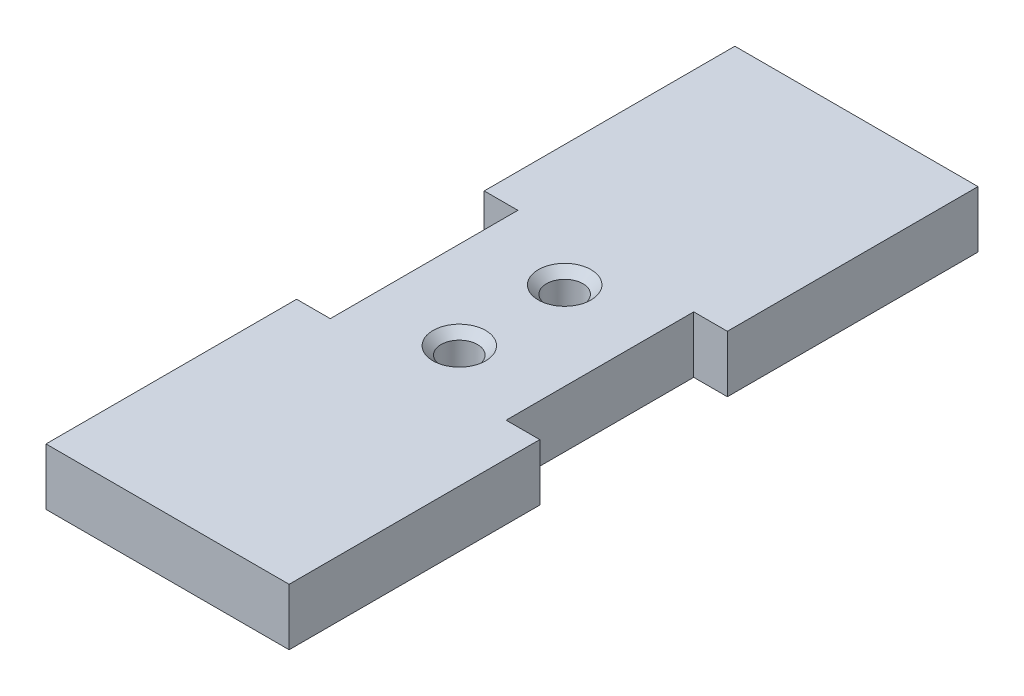
ISO-10303-21;
HEADER;
FILE_DESCRIPTION(('STEP AP214'),'2;1');
FILE_NAME('part.step','',(''),(''),'','','');
FILE_SCHEMA(('AUTOMOTIVE_DESIGN { 1 0 10303 214 1 1 1 1 }'));
ENDSEC;
DATA;
#1=APPLICATION_CONTEXT('core data for automotive mechanical design processes');
#2=APPLICATION_PROTOCOL_DEFINITION('international standard','automotive_design',2000,#1);
#3=PRODUCT_CONTEXT('',#1,'mechanical');
#4=PRODUCT('Part','Part','',(#3));
#5=PRODUCT_RELATED_PRODUCT_CATEGORY('part','',(#4));
#6=PRODUCT_DEFINITION_FORMATION('','',#4);
#7=PRODUCT_DEFINITION_CONTEXT('part definition',#1,'design');
#8=PRODUCT_DEFINITION('design','',#6,#7);
#9=PRODUCT_DEFINITION_SHAPE('','',#8);
#10=(LENGTH_UNIT() NAMED_UNIT(*) SI_UNIT(.MILLI.,.METRE.));
#11=(NAMED_UNIT(*) PLANE_ANGLE_UNIT() SI_UNIT($,.RADIAN.));
#12=(NAMED_UNIT(*) SI_UNIT($,.STERADIAN.) SOLID_ANGLE_UNIT());
#13=UNCERTAINTY_MEASURE_WITH_UNIT(LENGTH_MEASURE(1.E-05),#10,'distance_accuracy_value','');
#14=(GEOMETRIC_REPRESENTATION_CONTEXT(3) GLOBAL_UNCERTAINTY_ASSIGNED_CONTEXT((#13)) GLOBAL_UNIT_ASSIGNED_CONTEXT((#10,
#11,#12)) REPRESENTATION_CONTEXT('',''));
#15=CARTESIAN_POINT('',(0.,0.,0.));
#16=DIRECTION('',(0.,0.,1.));
#17=DIRECTION('',(1.,0.,0.));
#18=AXIS2_PLACEMENT_3D('',#15,#16,#17);
#19=CARTESIAN_POINT('',(0.,7.,0.));
#20=DIRECTION('',(1.,0.,0.));
#21=DIRECTION('',(0.,0.,-1.));
#22=AXIS2_PLACEMENT_3D('',#19,#20,#21);
#23=PLANE('',#22);
#24=DIRECTION('',(0.,0.,1.));
#25=VECTOR('',#24,1.);
#26=CARTESIAN_POINT('',(0.,0.,0.));
#27=LINE('',#26,#25);
#28=CARTESIAN_POINT('',(0.,0.,-85.));
#29=VERTEX_POINT('',#28);
#30=CARTESIAN_POINT('',(0.,0.,-54.075));
#31=VERTEX_POINT('',#30);
#32=EDGE_CURVE('E168',#29,#31,#27,.T.);
#33=ORIENTED_EDGE('',*,*,#32,.T.);
#34=DIRECTION('',(0.,1.,0.));
#35=VECTOR('',#34,1.);
#36=CARTESIAN_POINT('',(0.,0.,-54.075));
#37=LINE('',#36,#35);
#38=CARTESIAN_POINT('',(0.,7.,-54.075));
#39=VERTEX_POINT('',#38);
#40=EDGE_CURVE('E224',#31,#39,#37,.T.);
#41=ORIENTED_EDGE('',*,*,#40,.T.);
#42=DIRECTION('',(0.,0.,1.));
#43=VECTOR('',#42,1.);
#44=CARTESIAN_POINT('',(0.,7.,0.));
#45=LINE('',#44,#43);
#46=CARTESIAN_POINT('',(0.,7.,-85.));
#47=VERTEX_POINT('',#46);
#48=EDGE_CURVE('E283',#47,#39,#45,.T.);
#49=ORIENTED_EDGE('',*,*,#48,.F.);
#50=DIRECTION('',(0.,-1.,0.));
#51=VECTOR('',#50,1.);
#52=CARTESIAN_POINT('',(0.,7.,-85.));
#53=LINE('',#52,#51);
#54=EDGE_CURVE('E175',#47,#29,#53,.T.);
#55=ORIENTED_EDGE('',*,*,#54,.T.);
#56=EDGE_LOOP('',(#33,#41,#49,#55));
#57=FACE_BOUND('',#56,.T.);
#58=ADVANCED_FACE('F44',(#57),#23,.F.);
#59=CARTESIAN_POINT('',(30.,7.,0.));
#60=DIRECTION('',(-1.,0.,0.));
#61=DIRECTION('',(0.,0.,1.));
#62=AXIS2_PLACEMENT_3D('',#59,#60,#61);
#63=PLANE('',#62);
#64=DIRECTION('',(0.,0.,-1.));
#65=VECTOR('',#64,1.);
#66=CARTESIAN_POINT('',(30.,0.,0.));
#67=LINE('',#66,#65);
#68=CARTESIAN_POINT('',(30.,0.,0.));
#69=VERTEX_POINT('',#68);
#70=CARTESIAN_POINT('',(30.,0.,-30.925));
#71=VERTEX_POINT('',#70);
#72=EDGE_CURVE('E162',#69,#71,#67,.T.);
#73=ORIENTED_EDGE('',*,*,#72,.T.);
#74=DIRECTION('',(0.,1.,0.));
#75=VECTOR('',#74,1.);
#76=CARTESIAN_POINT('',(30.,0.,-30.925));
#77=LINE('',#76,#75);
#78=CARTESIAN_POINT('',(30.,7.,-30.925));
#79=VERTEX_POINT('',#78);
#80=EDGE_CURVE('E241',#71,#79,#77,.T.);
#81=ORIENTED_EDGE('',*,*,#80,.T.);
#82=DIRECTION('',(0.,0.,-1.));
#83=VECTOR('',#82,1.);
#84=CARTESIAN_POINT('',(30.,7.,0.));
#85=LINE('',#84,#83);
#86=CARTESIAN_POINT('',(30.,7.,0.));
#87=VERTEX_POINT('',#86);
#88=EDGE_CURVE('E290',#87,#79,#85,.T.);
#89=ORIENTED_EDGE('',*,*,#88,.F.);
#90=DIRECTION('',(0.,-1.,0.));
#91=VECTOR('',#90,1.);
#92=CARTESIAN_POINT('',(30.,7.,0.));
#93=LINE('',#92,#91);
#94=EDGE_CURVE('E183',#87,#69,#93,.T.);
#95=ORIENTED_EDGE('',*,*,#94,.T.);
#96=EDGE_LOOP('',(#73,#81,#89,#95));
#97=FACE_BOUND('',#96,.T.);
#98=ADVANCED_FACE('F344',(#97),#63,.F.);
#99=CARTESIAN_POINT('',(0.,7.,-30.925));
#100=VERTEX_POINT('',#99);
#101=CARTESIAN_POINT('',(0.,7.,0.));
#102=VERTEX_POINT('',#101);
#103=EDGE_CURVE('E174',#100,#102,#45,.T.);
#104=ORIENTED_EDGE('',*,*,#103,.F.);
#105=DIRECTION('',(0.,1.,0.));
#106=VECTOR('',#105,1.);
#107=CARTESIAN_POINT('',(0.,0.,-30.925));
#108=LINE('',#107,#106);
#109=CARTESIAN_POINT('',(0.,0.,-30.925));
#110=VERTEX_POINT('',#109);
#111=EDGE_CURVE('E251',#110,#100,#108,.T.);
#112=ORIENTED_EDGE('',*,*,#111,.F.);
#113=CARTESIAN_POINT('',(0.,0.,0.));
#114=VERTEX_POINT('',#113);
#115=EDGE_CURVE('E245',#110,#114,#27,.T.);
#116=ORIENTED_EDGE('',*,*,#115,.T.);
#117=DIRECTION('',(0.,-1.,0.));
#118=VECTOR('',#117,1.);
#119=CARTESIAN_POINT('',(0.,7.,0.));
#120=LINE('',#119,#118);
#121=EDGE_CURVE('E187',#102,#114,#120,.T.);
#122=ORIENTED_EDGE('',*,*,#121,.F.);
#123=EDGE_LOOP('',(#104,#112,#116,#122));
#124=FACE_BOUND('',#123,.T.);
#125=ADVANCED_FACE('F305',(#124),#23,.F.);
#126=CARTESIAN_POINT('',(0.,7.,0.));
#127=DIRECTION('',(0.,0.,-1.));
#128=DIRECTION('',(-1.,0.,0.));
#129=AXIS2_PLACEMENT_3D('',#126,#127,#128);
#130=PLANE('',#129);
#131=DIRECTION('',(1.,0.,0.));
#132=VECTOR('',#131,1.);
#133=CARTESIAN_POINT('',(0.,0.,0.));
#134=LINE('',#133,#132);
#135=EDGE_CURVE('E163',#114,#69,#134,.T.);
#136=ORIENTED_EDGE('',*,*,#135,.T.);
#137=ORIENTED_EDGE('',*,*,#94,.F.);
#138=DIRECTION('',(1.,0.,0.));
#139=VECTOR('',#138,1.);
#140=CARTESIAN_POINT('',(0.,7.,0.));
#141=LINE('',#140,#139);
#142=EDGE_CURVE('E287',#102,#87,#141,.T.);
#143=ORIENTED_EDGE('',*,*,#142,.F.);
#144=ORIENTED_EDGE('',*,*,#121,.T.);
#145=EDGE_LOOP('',(#136,#137,#143,#144));
#146=FACE_BOUND('',#145,.T.);
#147=ADVANCED_FACE('F310',(#146),#130,.F.);
#148=CARTESIAN_POINT('',(30.,7.,-54.075));
#149=VERTEX_POINT('',#148);
#150=CARTESIAN_POINT('',(30.,7.,-85.));
#151=VERTEX_POINT('',#150);
#152=EDGE_CURVE('E152',#149,#151,#85,.T.);
#153=ORIENTED_EDGE('',*,*,#152,.F.);
#154=DIRECTION('',(0.,1.,0.));
#155=VECTOR('',#154,1.);
#156=CARTESIAN_POINT('',(30.,0.,-54.075));
#157=LINE('',#156,#155);
#158=CARTESIAN_POINT('',(30.,0.,-54.075));
#159=VERTEX_POINT('',#158);
#160=EDGE_CURVE('E138',#159,#149,#157,.T.);
#161=ORIENTED_EDGE('',*,*,#160,.F.);
#162=CARTESIAN_POINT('',(30.,0.,-85.));
#163=VERTEX_POINT('',#162);
#164=EDGE_CURVE('E150',#159,#163,#67,.T.);
#165=ORIENTED_EDGE('',*,*,#164,.T.);
#166=DIRECTION('',(0.,-1.,0.));
#167=VECTOR('',#166,1.);
#168=CARTESIAN_POINT('',(30.,7.,-85.));
#169=LINE('',#168,#167);
#170=EDGE_CURVE('E179',#151,#163,#169,.T.);
#171=ORIENTED_EDGE('',*,*,#170,.F.);
#172=EDGE_LOOP('',(#153,#161,#165,#171));
#173=FACE_BOUND('',#172,.T.);
#174=ADVANCED_FACE('F148',(#173),#63,.F.);
#175=CARTESIAN_POINT('',(0.,7.,-85.));
#176=DIRECTION('',(0.,0.,1.));
#177=DIRECTION('',(1.,0.,0.));
#178=AXIS2_PLACEMENT_3D('',#175,#176,#177);
#179=PLANE('',#178);
#180=DIRECTION('',(-1.,0.,0.));
#181=VECTOR('',#180,1.);
#182=CARTESIAN_POINT('',(0.,0.,-85.));
#183=LINE('',#182,#181);
#184=EDGE_CURVE('E160',#163,#29,#183,.T.);
#185=ORIENTED_EDGE('',*,*,#184,.T.);
#186=ORIENTED_EDGE('',*,*,#54,.F.);
#187=DIRECTION('',(-1.,0.,0.));
#188=VECTOR('',#187,1.);
#189=CARTESIAN_POINT('',(0.,7.,-85.));
#190=LINE('',#189,#188);
#191=EDGE_CURVE('E180',#151,#47,#190,.T.);
#192=ORIENTED_EDGE('',*,*,#191,.F.);
#193=ORIENTED_EDGE('',*,*,#170,.T.);
#194=EDGE_LOOP('',(#185,#186,#192,#193));
#195=FACE_BOUND('',#194,.T.);
#196=ADVANCED_FACE('F322',(#195),#179,.F.);
#197=CARTESIAN_POINT('',(0.,7.,0.));
#198=DIRECTION('',(0.,-1.,0.));
#199=DIRECTION('',(0.,0.,-1.));
#200=AXIS2_PLACEMENT_3D('',#197,#198,#199);
#201=PLANE('',#200);
#202=CARTESIAN_POINT('',(15.,7.,-36.));
#203=DIRECTION('',(0.,-1.,0.));
#204=DIRECTION('',(0.,0.,-1.));
#205=AXIS2_PLACEMENT_3D('',#202,#203,#204);
#206=CIRCLE('',#205,3.25000000000003);
#207=CARTESIAN_POINT('',(15.,7.,-39.25));
#208=VERTEX_POINT('',#207);
#209=EDGE_CURVE('E54',#208,#208,#206,.T.);
#210=ORIENTED_EDGE('',*,*,#209,.T.);
#211=EDGE_LOOP('',(#210));
#212=FACE_BOUND('',#211,.T.);
#213=CARTESIAN_POINT('',(15.,7.,-49.));
#214=DIRECTION('',(0.,-1.,0.));
#215=DIRECTION('',(0.,0.,-1.));
#216=AXIS2_PLACEMENT_3D('',#213,#214,#215);
#217=CIRCLE('',#216,3.25000000000003);
#218=CARTESIAN_POINT('',(15.,7.,-52.25));
#219=VERTEX_POINT('',#218);
#220=EDGE_CURVE('E195',#219,#219,#217,.T.);
#221=ORIENTED_EDGE('',*,*,#220,.T.);
#222=EDGE_LOOP('',(#221));
#223=FACE_BOUND('',#222,.T.);
#224=ORIENTED_EDGE('',*,*,#88,.T.);
#225=DIRECTION('',(1.,0.,0.));
#226=VECTOR('',#225,1.);
#227=CARTESIAN_POINT('',(25.85,7.,-30.925));
#228=LINE('',#227,#226);
#229=CARTESIAN_POINT('',(25.85,7.,-30.925));
#230=VERTEX_POINT('',#229);
#231=EDGE_CURVE('E144',#230,#79,#228,.T.);
#232=ORIENTED_EDGE('',*,*,#231,.F.);
#233=DIRECTION('',(0.,0.,1.));
#234=VECTOR('',#233,1.);
#235=CARTESIAN_POINT('',(25.85,7.,-54.075));
#236=LINE('',#235,#234);
#237=CARTESIAN_POINT('',(25.85,7.,-54.075));
#238=VERTEX_POINT('',#237);
#239=EDGE_CURVE('E234',#238,#230,#236,.T.);
#240=ORIENTED_EDGE('',*,*,#239,.F.);
#241=DIRECTION('',(-1.,0.,0.));
#242=VECTOR('',#241,1.);
#243=CARTESIAN_POINT('',(30.,7.,-54.075));
#244=LINE('',#243,#242);
#245=EDGE_CURVE('E231',#149,#238,#244,.T.);
#246=ORIENTED_EDGE('',*,*,#245,.F.);
#247=ORIENTED_EDGE('',*,*,#152,.T.);
#248=ORIENTED_EDGE('',*,*,#191,.T.);
#249=ORIENTED_EDGE('',*,*,#48,.T.);
#250=DIRECTION('',(-1.,0.,0.));
#251=VECTOR('',#250,1.);
#252=CARTESIAN_POINT('',(0.,7.,-54.075));
#253=LINE('',#252,#251);
#254=CARTESIAN_POINT('',(4.14999999999998,7.,-54.075));
#255=VERTEX_POINT('',#254);
#256=EDGE_CURVE('E264',#255,#39,#253,.T.);
#257=ORIENTED_EDGE('',*,*,#256,.F.);
#258=DIRECTION('',(0.,0.,-1.));
#259=VECTOR('',#258,1.);
#260=CARTESIAN_POINT('',(4.14999999999998,7.,-54.075));
#261=LINE('',#260,#259);
#262=CARTESIAN_POINT('',(4.14999999999998,7.,-30.925));
#263=VERTEX_POINT('',#262);
#264=EDGE_CURVE('E267',#263,#255,#261,.T.);
#265=ORIENTED_EDGE('',*,*,#264,.F.);
#266=DIRECTION('',(1.,0.,0.));
#267=VECTOR('',#266,1.);
#268=CARTESIAN_POINT('',(4.14999999999998,7.,-30.925));
#269=LINE('',#268,#267);
#270=EDGE_CURVE('E235',#100,#263,#269,.T.);
#271=ORIENTED_EDGE('',*,*,#270,.F.);
#272=ORIENTED_EDGE('',*,*,#103,.T.);
#273=ORIENTED_EDGE('',*,*,#142,.T.);
#274=EDGE_LOOP('',(#224,#232,#240,#246,#247,#248,#249,#257,#265,#271,#272,#273));
#275=FACE_BOUND('',#274,.T.);
#276=ADVANCED_FACE('F202',(#212,#223,#275),#201,.F.);
#277=CARTESIAN_POINT('',(0.,0.,0.));
#278=DIRECTION('',(0.,-1.,0.));
#279=DIRECTION('',(0.,0.,-1.));
#280=AXIS2_PLACEMENT_3D('',#277,#278,#279);
#281=PLANE('',#280);
#282=CARTESIAN_POINT('',(15.,0.,-49.));
#283=DIRECTION('',(0.,1.,0.));
#284=DIRECTION('',(0.,0.,1.));
#285=AXIS2_PLACEMENT_3D('',#282,#283,#284);
#286=CIRCLE('',#285,2.25);
#287=CARTESIAN_POINT('',(15.,0.,-46.75));
#288=VERTEX_POINT('',#287);
#289=EDGE_CURVE('E220',#288,#288,#286,.T.);
#290=ORIENTED_EDGE('',*,*,#289,.T.);
#291=EDGE_LOOP('',(#290));
#292=FACE_BOUND('',#291,.T.);
#293=CARTESIAN_POINT('',(15.,0.,-36.));
#294=DIRECTION('',(0.,1.,0.));
#295=DIRECTION('',(0.,0.,-1.));
#296=AXIS2_PLACEMENT_3D('',#293,#294,#295);
#297=CIRCLE('',#296,2.25000000000001);
#298=CARTESIAN_POINT('',(15.,0.,-38.25));
#299=VERTEX_POINT('',#298);
#300=EDGE_CURVE('E217',#299,#299,#297,.T.);
#301=ORIENTED_EDGE('',*,*,#300,.T.);
#302=EDGE_LOOP('',(#301));
#303=FACE_BOUND('',#302,.T.);
#304=DIRECTION('',(1.,0.,0.));
#305=VECTOR('',#304,1.);
#306=CARTESIAN_POINT('',(25.85,0.,-30.925));
#307=LINE('',#306,#305);
#308=CARTESIAN_POINT('',(25.85,0.,-30.925));
#309=VERTEX_POINT('',#308);
#310=EDGE_CURVE('E154',#309,#71,#307,.T.);
#311=ORIENTED_EDGE('',*,*,#310,.T.);
#312=ORIENTED_EDGE('',*,*,#72,.F.);
#313=ORIENTED_EDGE('',*,*,#135,.F.);
#314=ORIENTED_EDGE('',*,*,#115,.F.);
#315=DIRECTION('',(1.,0.,0.));
#316=VECTOR('',#315,1.);
#317=CARTESIAN_POINT('',(4.14999999999998,0.,-30.925));
#318=LINE('',#317,#316);
#319=CARTESIAN_POINT('',(4.14999999999998,0.,-30.925));
#320=VERTEX_POINT('',#319);
#321=EDGE_CURVE('E268',#110,#320,#318,.T.);
#322=ORIENTED_EDGE('',*,*,#321,.T.);
#323=DIRECTION('',(0.,0.,-1.));
#324=VECTOR('',#323,1.);
#325=CARTESIAN_POINT('',(4.14999999999998,0.,-54.075));
#326=LINE('',#325,#324);
#327=CARTESIAN_POINT('',(4.14999999999998,0.,-54.075));
#328=VERTEX_POINT('',#327);
#329=EDGE_CURVE('E69',#320,#328,#326,.T.);
#330=ORIENTED_EDGE('',*,*,#329,.T.);
#331=DIRECTION('',(-1.,0.,0.));
#332=VECTOR('',#331,1.);
#333=CARTESIAN_POINT('',(0.,0.,-54.075));
#334=LINE('',#333,#332);
#335=EDGE_CURVE('E254',#328,#31,#334,.T.);
#336=ORIENTED_EDGE('',*,*,#335,.T.);
#337=ORIENTED_EDGE('',*,*,#32,.F.);
#338=ORIENTED_EDGE('',*,*,#184,.F.);
#339=ORIENTED_EDGE('',*,*,#164,.F.);
#340=DIRECTION('',(-1.,0.,0.));
#341=VECTOR('',#340,1.);
#342=CARTESIAN_POINT('',(30.,0.,-54.075));
#343=LINE('',#342,#341);
#344=CARTESIAN_POINT('',(25.85,0.,-54.075));
#345=VERTEX_POINT('',#344);
#346=EDGE_CURVE('E134',#159,#345,#343,.T.);
#347=ORIENTED_EDGE('',*,*,#346,.T.);
#348=DIRECTION('',(0.,0.,1.));
#349=VECTOR('',#348,1.);
#350=CARTESIAN_POINT('',(25.85,0.,-54.075));
#351=LINE('',#350,#349);
#352=EDGE_CURVE('E61',#345,#309,#351,.T.);
#353=ORIENTED_EDGE('',*,*,#352,.T.);
#354=EDGE_LOOP('',(#311,#312,#313,#314,#322,#330,#336,#337,#338,#339,#347,#353));
#355=FACE_BOUND('',#354,.T.);
#356=ADVANCED_FACE('F158',(#292,#303,#355),#281,.T.);
#357=CARTESIAN_POINT('',(0.,0.,-54.075));
#358=DIRECTION('',(0.,0.,-1.));
#359=DIRECTION('',(-1.,0.,0.));
#360=AXIS2_PLACEMENT_3D('',#357,#358,#359);
#361=PLANE('',#360);
#362=ORIENTED_EDGE('',*,*,#256,.T.);
#363=ORIENTED_EDGE('',*,*,#40,.F.);
#364=ORIENTED_EDGE('',*,*,#335,.F.);
#365=DIRECTION('',(0.,1.,0.));
#366=VECTOR('',#365,1.);
#367=CARTESIAN_POINT('',(4.14999999999998,0.,-54.075));
#368=LINE('',#367,#366);
#369=EDGE_CURVE('E258',#328,#255,#368,.T.);
#370=ORIENTED_EDGE('',*,*,#369,.T.);
#371=EDGE_LOOP('',(#362,#363,#364,#370));
#372=FACE_BOUND('',#371,.T.);
#373=ADVANCED_FACE('F326',(#372),#361,.F.);
#374=CARTESIAN_POINT('',(4.14999999999998,0.,-54.075));
#375=DIRECTION('',(1.,0.,0.));
#376=DIRECTION('',(0.,0.,-1.));
#377=AXIS2_PLACEMENT_3D('',#374,#375,#376);
#378=PLANE('',#377);
#379=ORIENTED_EDGE('',*,*,#264,.T.);
#380=ORIENTED_EDGE('',*,*,#369,.F.);
#381=ORIENTED_EDGE('',*,*,#329,.F.);
#382=DIRECTION('',(0.,1.,0.));
#383=VECTOR('',#382,1.);
#384=CARTESIAN_POINT('',(4.14999999999998,0.,-30.925));
#385=LINE('',#384,#383);
#386=EDGE_CURVE('E255',#320,#263,#385,.T.);
#387=ORIENTED_EDGE('',*,*,#386,.T.);
#388=EDGE_LOOP('',(#379,#380,#381,#387));
#389=FACE_BOUND('',#388,.T.);
#390=ADVANCED_FACE('F328',(#389),#378,.F.);
#391=CARTESIAN_POINT('',(4.14999999999998,0.,-30.925));
#392=DIRECTION('',(0.,0.,1.));
#393=DIRECTION('',(1.,0.,0.));
#394=AXIS2_PLACEMENT_3D('',#391,#392,#393);
#395=PLANE('',#394);
#396=ORIENTED_EDGE('',*,*,#270,.T.);
#397=ORIENTED_EDGE('',*,*,#386,.F.);
#398=ORIENTED_EDGE('',*,*,#321,.F.);
#399=ORIENTED_EDGE('',*,*,#111,.T.);
#400=EDGE_LOOP('',(#396,#397,#398,#399));
#401=FACE_BOUND('',#400,.T.);
#402=ADVANCED_FACE('F330',(#401),#395,.F.);
#403=CARTESIAN_POINT('',(25.85,0.,-30.925));
#404=DIRECTION('',(0.,0.,1.));
#405=DIRECTION('',(1.,0.,0.));
#406=AXIS2_PLACEMENT_3D('',#403,#404,#405);
#407=PLANE('',#406);
#408=ORIENTED_EDGE('',*,*,#231,.T.);
#409=ORIENTED_EDGE('',*,*,#80,.F.);
#410=ORIENTED_EDGE('',*,*,#310,.F.);
#411=DIRECTION('',(0.,1.,0.));
#412=VECTOR('',#411,1.);
#413=CARTESIAN_POINT('',(25.85,0.,-30.925));
#414=LINE('',#413,#412);
#415=EDGE_CURVE('E246',#309,#230,#414,.T.);
#416=ORIENTED_EDGE('',*,*,#415,.T.);
#417=EDGE_LOOP('',(#408,#409,#410,#416));
#418=FACE_BOUND('',#417,.T.);
#419=ADVANCED_FACE('F332',(#418),#407,.F.);
#420=CARTESIAN_POINT('',(25.85,0.,-54.075));
#421=DIRECTION('',(-1.,0.,0.));
#422=DIRECTION('',(0.,0.,1.));
#423=AXIS2_PLACEMENT_3D('',#420,#421,#422);
#424=PLANE('',#423);
#425=ORIENTED_EDGE('',*,*,#239,.T.);
#426=ORIENTED_EDGE('',*,*,#415,.F.);
#427=ORIENTED_EDGE('',*,*,#352,.F.);
#428=DIRECTION('',(0.,1.,0.));
#429=VECTOR('',#428,1.);
#430=CARTESIAN_POINT('',(25.85,0.,-54.075));
#431=LINE('',#430,#429);
#432=EDGE_CURVE('E140',#345,#238,#431,.T.);
#433=ORIENTED_EDGE('',*,*,#432,.T.);
#434=EDGE_LOOP('',(#425,#426,#427,#433));
#435=FACE_BOUND('',#434,.T.);
#436=ADVANCED_FACE('F338',(#435),#424,.F.);
#437=CARTESIAN_POINT('',(30.,0.,-54.075));
#438=DIRECTION('',(0.,0.,-1.));
#439=DIRECTION('',(-1.,0.,0.));
#440=AXIS2_PLACEMENT_3D('',#437,#438,#439);
#441=PLANE('',#440);
#442=ORIENTED_EDGE('',*,*,#245,.T.);
#443=ORIENTED_EDGE('',*,*,#432,.F.);
#444=ORIENTED_EDGE('',*,*,#346,.F.);
#445=ORIENTED_EDGE('',*,*,#160,.T.);
#446=EDGE_LOOP('',(#442,#443,#444,#445));
#447=FACE_BOUND('',#446,.T.);
#448=ADVANCED_FACE('F137',(#447),#441,.F.);
#449=CARTESIAN_POINT('',(15.,0.,-36.));
#450=DIRECTION('',(0.,1.,0.));
#451=DIRECTION('',(0.,0.,1.));
#452=AXIS2_PLACEMENT_3D('',#449,#450,#451);
#453=CYLINDRICAL_SURFACE('',#452,2.25000000000001);
#454=CARTESIAN_POINT('',(15.,5.99999999999998,-36.));
#455=DIRECTION('',(0.,-1.,0.));
#456=DIRECTION('',(0.,0.,-1.));
#457=AXIS2_PLACEMENT_3D('',#454,#455,#456);
#458=CIRCLE('',#457,2.25000000000001);
#459=CARTESIAN_POINT('',(15.,5.99999999999998,-38.25));
#460=VERTEX_POINT('',#459);
#461=EDGE_CURVE('E191',#460,#460,#458,.F.);
#462=ORIENTED_EDGE('',*,*,#461,.T.);
#463=EDGE_LOOP('',(#462));
#464=FACE_BOUND('',#463,.T.);
#465=ORIENTED_EDGE('',*,*,#300,.F.);
#466=EDGE_LOOP('',(#465));
#467=FACE_BOUND('',#466,.T.);
#468=ADVANCED_FACE('F211',(#464,#467),#453,.F.);
#469=CARTESIAN_POINT('',(15.,0.,-49.));
#470=DIRECTION('',(0.,1.,0.));
#471=DIRECTION('',(0.,0.,1.));
#472=AXIS2_PLACEMENT_3D('',#469,#470,#471);
#473=CYLINDRICAL_SURFACE('',#472,2.25);
#474=CARTESIAN_POINT('',(15.,5.99999999999998,-49.));
#475=DIRECTION('',(0.,-1.,0.));
#476=DIRECTION('',(0.,0.,-1.));
#477=AXIS2_PLACEMENT_3D('',#474,#475,#476);
#478=CIRCLE('',#477,2.25);
#479=CARTESIAN_POINT('',(15.,5.99999999999998,-51.25));
#480=VERTEX_POINT('',#479);
#481=EDGE_CURVE('E11',#480,#480,#478,.F.);
#482=ORIENTED_EDGE('',*,*,#481,.T.);
#483=EDGE_LOOP('',(#482));
#484=FACE_BOUND('',#483,.T.);
#485=ORIENTED_EDGE('',*,*,#289,.F.);
#486=EDGE_LOOP('',(#485));
#487=FACE_BOUND('',#486,.T.);
#488=ADVANCED_FACE('F208',(#484,#487),#473,.F.);
#489=CARTESIAN_POINT('',(15.,5.99999999999998,-36.));
#490=DIRECTION('',(0.,1.,0.));
#491=DIRECTION('',(0.,0.,1.));
#492=AXIS2_PLACEMENT_3D('',#489,#490,#491);
#493=CONICAL_SURFACE('',#492,2.25000000000001,0.785398163397451);
#494=ORIENTED_EDGE('',*,*,#209,.F.);
#495=EDGE_LOOP('',(#494));
#496=FACE_BOUND('',#495,.T.);
#497=ORIENTED_EDGE('',*,*,#461,.F.);
#498=EDGE_LOOP('',(#497));
#499=FACE_BOUND('',#498,.T.);
#500=ADVANCED_FACE('F205',(#496,#499),#493,.F.);
#501=CARTESIAN_POINT('',(15.,5.99999999999998,-49.));
#502=DIRECTION('',(0.,1.,0.));
#503=DIRECTION('',(0.,0.,1.));
#504=AXIS2_PLACEMENT_3D('',#501,#502,#503);
#505=CONICAL_SURFACE('',#504,2.25,0.785398163397451);
#506=ORIENTED_EDGE('',*,*,#220,.F.);
#507=EDGE_LOOP('',(#506));
#508=FACE_BOUND('',#507,.T.);
#509=ORIENTED_EDGE('',*,*,#481,.F.);
#510=EDGE_LOOP('',(#509));
#511=FACE_BOUND('',#510,.T.);
#512=ADVANCED_FACE('F47',(#508,#511),#505,.F.);
#513=CLOSED_SHELL('',(#58,#98,#125,#147,#174,#196,#276,#356,#373,#390,#402,#419,#436,#448,#468,
#488,#500,#512));
#514=MANIFOLD_SOLID_BREP('B2',#513);
#515=ADVANCED_BREP_SHAPE_REPRESENTATION('',(#18,#514),#14);
#516=SHAPE_DEFINITION_REPRESENTATION(#9,#515);
ENDSEC;
END-ISO-10303-21;
